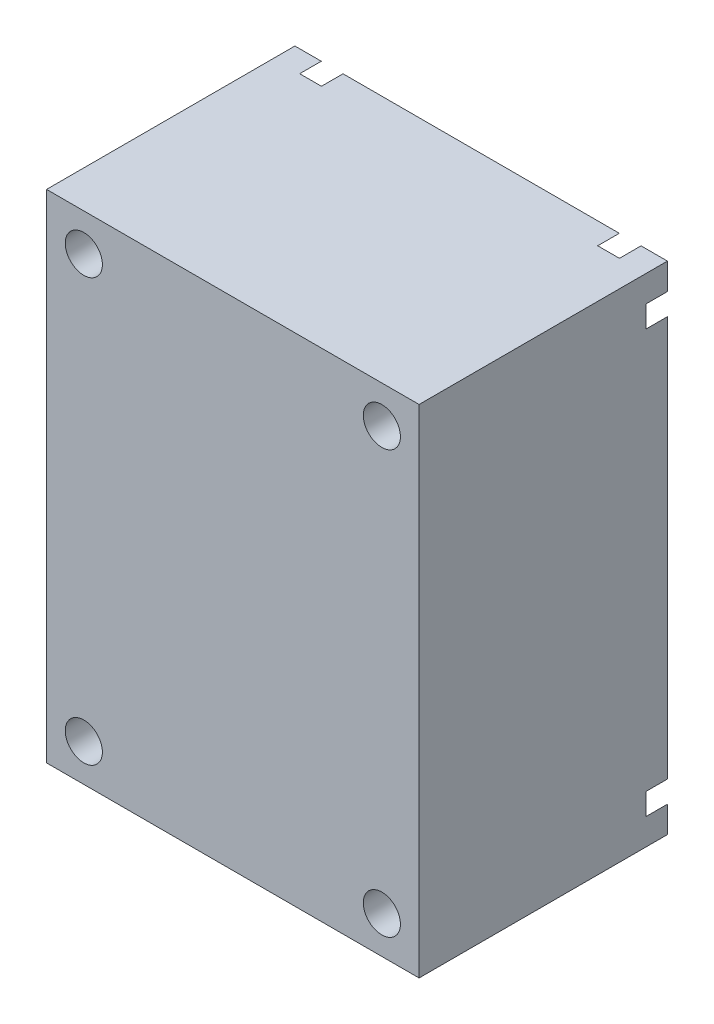
ISO-10303-21;
HEADER;
FILE_DESCRIPTION(('STEP AP214'),'2;1');
FILE_NAME('part.step','',(''),(''),'','','');
FILE_SCHEMA(('AUTOMOTIVE_DESIGN { 1 0 10303 214 1 1 1 1 }'));
ENDSEC;
DATA;
#1=APPLICATION_CONTEXT('core data for automotive mechanical design processes');
#2=APPLICATION_PROTOCOL_DEFINITION('international standard','automotive_design',2000,#1);
#3=PRODUCT_CONTEXT('',#1,'mechanical');
#4=PRODUCT('Part','Part','',(#3));
#5=PRODUCT_RELATED_PRODUCT_CATEGORY('part','',(#4));
#6=PRODUCT_DEFINITION_FORMATION('','',#4);
#7=PRODUCT_DEFINITION_CONTEXT('part definition',#1,'design');
#8=PRODUCT_DEFINITION('design','',#6,#7);
#9=PRODUCT_DEFINITION_SHAPE('','',#8);
#10=(LENGTH_UNIT() NAMED_UNIT(*) SI_UNIT(.MILLI.,.METRE.));
#11=(NAMED_UNIT(*) PLANE_ANGLE_UNIT() SI_UNIT($,.RADIAN.));
#12=(NAMED_UNIT(*) SI_UNIT($,.STERADIAN.) SOLID_ANGLE_UNIT());
#13=UNCERTAINTY_MEASURE_WITH_UNIT(LENGTH_MEASURE(1.E-05),#10,'distance_accuracy_value','');
#14=(GEOMETRIC_REPRESENTATION_CONTEXT(3) GLOBAL_UNCERTAINTY_ASSIGNED_CONTEXT((#13)) GLOBAL_UNIT_ASSIGNED_CONTEXT((#10,
#11,#12)) REPRESENTATION_CONTEXT('',''));
#15=CARTESIAN_POINT('',(0.,0.,0.));
#16=DIRECTION('',(0.,0.,1.));
#17=DIRECTION('',(1.,0.,0.));
#18=AXIS2_PLACEMENT_3D('',#15,#16,#17);
#19=CARTESIAN_POINT('',(0.,0.,-25.4));
#20=DIRECTION('',(0.,0.,-1.));
#21=DIRECTION('',(1.,0.,0.));
#22=AXIS2_PLACEMENT_3D('',#19,#20,#21);
#23=PLANE('',#22);
#24=CARTESIAN_POINT('',(-47.7550602409639,35.4375903614458,-25.4));
#25=DIRECTION('',(0.,0.,1.));
#26=DIRECTION('',(1.,0.,0.));
#27=AXIS2_PLACEMENT_3D('',#24,#25,#26);
#28=CIRCLE('',#27,3.96875);
#29=CARTESIAN_POINT('',(-48.8663102409638,39.2475903614458,-25.4));
#30=VERTEX_POINT('',#29);
#31=CARTESIAN_POINT('',(-51.5650602409639,36.5488403614458,-25.4));
#32=VERTEX_POINT('',#31);
#33=EDGE_CURVE('E179',#30,#32,#28,.T.);
#34=ORIENTED_EDGE('',*,*,#33,.T.);
#35=DIRECTION('',(0.,-1.,0.));
#36=VECTOR('',#35,1.);
#37=CARTESIAN_POINT('',(-51.5650602409639,39.2475903614458,-25.4));
#38=LINE('',#37,#36);
#39=CARTESIAN_POINT('',(-51.5650602409639,39.2475903614458,-25.4));
#40=VERTEX_POINT('',#39);
#41=EDGE_CURVE('E253',#40,#32,#38,.T.);
#42=ORIENTED_EDGE('',*,*,#41,.F.);
#43=DIRECTION('',(-1.,0.,0.));
#44=VECTOR('',#43,1.);
#45=CARTESIAN_POINT('',(-51.5650602409639,39.2475903614458,-25.4));
#46=LINE('',#45,#44);
#47=EDGE_CURVE('E242',#30,#40,#46,.T.);
#48=ORIENTED_EDGE('',*,*,#47,.F.);
#49=EDGE_LOOP('',(#34,#42,#48));
#50=FACE_BOUND('',#49,.T.);
#51=ADVANCED_FACE('F35',(#50),#23,.T.);
#52=CARTESIAN_POINT('',(-17.2750602409638,35.4375903614458,-25.4));
#53=DIRECTION('',(0.,0.,1.));
#54=DIRECTION('',(1.,0.,0.));
#55=AXIS2_PLACEMENT_3D('',#52,#53,#54);
#56=CIRCLE('',#55,3.96875);
#57=CARTESIAN_POINT('',(-13.4650602409638,36.5488403614458,-25.4));
#58=VERTEX_POINT('',#57);
#59=CARTESIAN_POINT('',(-16.1638102409638,39.2475903614458,-25.4));
#60=VERTEX_POINT('',#59);
#61=EDGE_CURVE('E313',#58,#60,#56,.T.);
#62=ORIENTED_EDGE('',*,*,#61,.T.);
#63=CARTESIAN_POINT('',(-13.4650602409638,39.2475903614458,-25.4));
#64=VERTEX_POINT('',#63);
#65=EDGE_CURVE('E226',#64,#60,#46,.T.);
#66=ORIENTED_EDGE('',*,*,#65,.F.);
#67=DIRECTION('',(0.,1.,0.));
#68=VECTOR('',#67,1.);
#69=CARTESIAN_POINT('',(-13.4650602409638,39.2475903614458,-25.4));
#70=LINE('',#69,#68);
#71=EDGE_CURVE('E247',#58,#64,#70,.T.);
#72=ORIENTED_EDGE('',*,*,#71,.F.);
#73=EDGE_LOOP('',(#62,#66,#72));
#74=FACE_BOUND('',#73,.T.);
#75=ADVANCED_FACE('F353',(#74),#23,.T.);
#76=CARTESIAN_POINT('',(-47.7550602409639,-7.74240963855422,-25.4));
#77=DIRECTION('',(0.,0.,1.));
#78=DIRECTION('',(1.,0.,0.));
#79=AXIS2_PLACEMENT_3D('',#76,#77,#78);
#80=CIRCLE('',#79,3.96875);
#81=CARTESIAN_POINT('',(-51.5650602409639,-8.85365963855422,-25.4));
#82=VERTEX_POINT('',#81);
#83=CARTESIAN_POINT('',(-48.8663102409638,-11.5524096385542,-25.4));
#84=VERTEX_POINT('',#83);
#85=EDGE_CURVE('E294',#82,#84,#80,.T.);
#86=ORIENTED_EDGE('',*,*,#85,.T.);
#87=DIRECTION('',(1.,0.,0.));
#88=VECTOR('',#87,1.);
#89=CARTESIAN_POINT('',(-51.5650602409639,-11.5524096385542,-25.4));
#90=LINE('',#89,#88);
#91=CARTESIAN_POINT('',(-51.5650602409639,-11.5524096385542,-25.4));
#92=VERTEX_POINT('',#91);
#93=EDGE_CURVE('E248',#92,#84,#90,.T.);
#94=ORIENTED_EDGE('',*,*,#93,.F.);
#95=EDGE_CURVE('E229',#82,#92,#38,.T.);
#96=ORIENTED_EDGE('',*,*,#95,.F.);
#97=EDGE_LOOP('',(#86,#94,#96));
#98=FACE_BOUND('',#97,.T.);
#99=ADVANCED_FACE('F368',(#98),#23,.T.);
#100=CARTESIAN_POINT('',(-51.5650602409639,34.3263403614458,-25.4));
#101=VERTEX_POINT('',#100);
#102=CARTESIAN_POINT('',(-46.6438102409639,39.2475903614458,-25.4));
#103=VERTEX_POINT('',#102);
#104=EDGE_CURVE('E328',#101,#103,#28,.T.);
#105=ORIENTED_EDGE('',*,*,#104,.T.);
#106=CARTESIAN_POINT('',(-18.3863102409638,39.2475903614458,-25.4));
#107=VERTEX_POINT('',#106);
#108=EDGE_CURVE('E185',#107,#103,#46,.T.);
#109=ORIENTED_EDGE('',*,*,#108,.F.);
#110=CARTESIAN_POINT('',(-13.4650602409638,34.3263403614457,-25.4));
#111=VERTEX_POINT('',#110);
#112=EDGE_CURVE('E316',#107,#111,#56,.T.);
#113=ORIENTED_EDGE('',*,*,#112,.T.);
#114=CARTESIAN_POINT('',(-13.4650602409638,-6.63115963855423,-25.4));
#115=VERTEX_POINT('',#114);
#116=EDGE_CURVE('E246',#115,#111,#70,.T.);
#117=ORIENTED_EDGE('',*,*,#116,.F.);
#118=CARTESIAN_POINT('',(-17.2750602409638,-7.74240963855423,-25.4));
#119=DIRECTION('',(0.,0.,1.));
#120=DIRECTION('',(1.,0.,0.));
#121=AXIS2_PLACEMENT_3D('',#118,#119,#120);
#122=CIRCLE('',#121,3.96875);
#123=CARTESIAN_POINT('',(-18.3863102409638,-11.5524096385542,-25.4));
#124=VERTEX_POINT('',#123);
#125=EDGE_CURVE('E273',#115,#124,#122,.T.);
#126=ORIENTED_EDGE('',*,*,#125,.T.);
#127=CARTESIAN_POINT('',(-46.6438102409639,-11.5524096385542,-25.4));
#128=VERTEX_POINT('',#127);
#129=EDGE_CURVE('E251',#128,#124,#90,.T.);
#130=ORIENTED_EDGE('',*,*,#129,.F.);
#131=CARTESIAN_POINT('',(-51.5650602409639,-6.63115963855423,-25.4));
#132=VERTEX_POINT('',#131);
#133=EDGE_CURVE('E295',#128,#132,#80,.T.);
#134=ORIENTED_EDGE('',*,*,#133,.T.);
#135=EDGE_CURVE('E256',#101,#132,#38,.T.);
#136=ORIENTED_EDGE('',*,*,#135,.F.);
#137=EDGE_LOOP('',(#105,#109,#113,#117,#126,#130,#134,#136));
#138=FACE_BOUND('',#137,.T.);
#139=ADVANCED_FACE('F366',(#138),#23,.T.);
#140=CARTESIAN_POINT('',(-51.5650602409639,39.2475903614458,-25.4));
#141=DIRECTION('',(1.,0.,0.));
#142=DIRECTION('',(0.,0.,1.));
#143=AXIS2_PLACEMENT_3D('',#140,#141,#142);
#144=PLANE('',#143);
#145=DIRECTION('',(0.,1.,0.));
#146=VECTOR('',#145,1.);
#147=CARTESIAN_POINT('',(-51.5650602409639,39.2475903614458,-23.1902));
#148=LINE('',#147,#146);
#149=CARTESIAN_POINT('',(-51.5650602409639,34.3263403614458,-23.1902));
#150=VERTEX_POINT('',#149);
#151=CARTESIAN_POINT('',(-51.5650602409639,36.5488403614458,-23.1902));
#152=VERTEX_POINT('',#151);
#153=EDGE_CURVE('E317',#150,#152,#148,.T.);
#154=ORIENTED_EDGE('',*,*,#153,.F.);
#155=DIRECTION('',(0.,0.,-1.));
#156=VECTOR('',#155,1.);
#157=CARTESIAN_POINT('',(-51.5650602409639,34.3263403614458,-25.4));
#158=LINE('',#157,#156);
#159=EDGE_CURVE('E177',#101,#150,#158,.F.);
#160=ORIENTED_EDGE('',*,*,#159,.F.);
#161=ORIENTED_EDGE('',*,*,#135,.T.);
#162=DIRECTION('',(0.,0.,-1.));
#163=VECTOR('',#162,1.);
#164=CARTESIAN_POINT('',(-51.5650602409639,-6.63115963855423,-25.4));
#165=LINE('',#164,#163);
#166=CARTESIAN_POINT('',(-51.5650602409639,-6.63115963855423,-23.1902));
#167=VERTEX_POINT('',#166);
#168=EDGE_CURVE('E197',#167,#132,#165,.T.);
#169=ORIENTED_EDGE('',*,*,#168,.F.);
#170=DIRECTION('',(0.,1.,0.));
#171=VECTOR('',#170,1.);
#172=CARTESIAN_POINT('',(-51.5650602409639,39.2475903614458,-23.1902));
#173=LINE('',#172,#171);
#174=CARTESIAN_POINT('',(-51.5650602409639,-8.85365963855422,-23.1902));
#175=VERTEX_POINT('',#174);
#176=EDGE_CURVE('E199',#175,#167,#173,.T.);
#177=ORIENTED_EDGE('',*,*,#176,.F.);
#178=DIRECTION('',(0.,0.,-1.));
#179=VECTOR('',#178,1.);
#180=CARTESIAN_POINT('',(-51.5650602409639,-8.85365963855422,-25.4));
#181=LINE('',#180,#179);
#182=EDGE_CURVE('E202',#82,#175,#181,.F.);
#183=ORIENTED_EDGE('',*,*,#182,.F.);
#184=ORIENTED_EDGE('',*,*,#95,.T.);
#185=DIRECTION('',(0.,0.,1.));
#186=VECTOR('',#185,1.);
#187=CARTESIAN_POINT('',(-51.5650602409639,-11.5524096385542,-25.4));
#188=LINE('',#187,#186);
#189=CARTESIAN_POINT('',(-51.5650602409639,-11.5524096385542,0.));
#190=VERTEX_POINT('',#189);
#191=EDGE_CURVE('E214',#92,#190,#188,.T.);
#192=ORIENTED_EDGE('',*,*,#191,.T.);
#193=DIRECTION('',(0.,-1.,0.));
#194=VECTOR('',#193,1.);
#195=CARTESIAN_POINT('',(-51.5650602409639,39.2475903614458,0.));
#196=LINE('',#195,#194);
#197=CARTESIAN_POINT('',(-51.5650602409639,39.2475903614458,0.));
#198=VERTEX_POINT('',#197);
#199=EDGE_CURVE('E236',#198,#190,#196,.T.);
#200=ORIENTED_EDGE('',*,*,#199,.F.);
#201=DIRECTION('',(0.,0.,1.));
#202=VECTOR('',#201,1.);
#203=CARTESIAN_POINT('',(-51.5650602409639,39.2475903614458,-25.4));
#204=LINE('',#203,#202);
#205=EDGE_CURVE('E223',#40,#198,#204,.T.);
#206=ORIENTED_EDGE('',*,*,#205,.F.);
#207=ORIENTED_EDGE('',*,*,#41,.T.);
#208=DIRECTION('',(0.,0.,-1.));
#209=VECTOR('',#208,1.);
#210=CARTESIAN_POINT('',(-51.5650602409639,36.5488403614458,-25.4));
#211=LINE('',#210,#209);
#212=EDGE_CURVE('E319',#152,#32,#211,.T.);
#213=ORIENTED_EDGE('',*,*,#212,.F.);
#214=EDGE_LOOP('',(#154,#160,#161,#169,#177,#183,#184,#192,#200,#206,#207,#213));
#215=FACE_BOUND('',#214,.T.);
#216=ADVANCED_FACE('F37',(#215),#144,.F.);
#217=CARTESIAN_POINT('',(-51.5650602409639,-11.5524096385542,-25.4));
#218=DIRECTION('',(0.,1.,0.));
#219=DIRECTION('',(-1.,0.,0.));
#220=AXIS2_PLACEMENT_3D('',#217,#218,#219);
#221=PLANE('',#220);
#222=DIRECTION('',(-1.,0.,0.));
#223=VECTOR('',#222,1.);
#224=CARTESIAN_POINT('',(-51.5650602409639,-11.5524096385542,-23.1902));
#225=LINE('',#224,#223);
#226=CARTESIAN_POINT('',(-46.6438102409639,-11.5524096385542,-23.1902));
#227=VERTEX_POINT('',#226);
#228=CARTESIAN_POINT('',(-48.8663102409638,-11.5524096385542,-23.1902));
#229=VERTEX_POINT('',#228);
#230=EDGE_CURVE('E277',#227,#229,#225,.T.);
#231=ORIENTED_EDGE('',*,*,#230,.F.);
#232=DIRECTION('',(0.,0.,-1.));
#233=VECTOR('',#232,1.);
#234=CARTESIAN_POINT('',(-46.6438102409639,-11.5524096385542,-25.4));
#235=LINE('',#234,#233);
#236=EDGE_CURVE('E282',#128,#227,#235,.F.);
#237=ORIENTED_EDGE('',*,*,#236,.F.);
#238=ORIENTED_EDGE('',*,*,#129,.T.);
#239=DIRECTION('',(0.,0.,-1.));
#240=VECTOR('',#239,1.);
#241=CARTESIAN_POINT('',(-18.3863102409638,-11.5524096385542,-25.4));
#242=LINE('',#241,#240);
#243=CARTESIAN_POINT('',(-18.3863102409638,-11.5524096385542,-23.1902));
#244=VERTEX_POINT('',#243);
#245=EDGE_CURVE('E259',#244,#124,#242,.T.);
#246=ORIENTED_EDGE('',*,*,#245,.F.);
#247=DIRECTION('',(-1.,0.,0.));
#248=VECTOR('',#247,1.);
#249=CARTESIAN_POINT('',(-51.5650602409639,-11.5524096385542,-23.1902));
#250=LINE('',#249,#248);
#251=CARTESIAN_POINT('',(-16.1638102409639,-11.5524096385542,-23.1902));
#252=VERTEX_POINT('',#251);
#253=EDGE_CURVE('E239',#252,#244,#250,.T.);
#254=ORIENTED_EDGE('',*,*,#253,.F.);
#255=DIRECTION('',(0.,0.,-1.));
#256=VECTOR('',#255,1.);
#257=CARTESIAN_POINT('',(-16.1638102409639,-11.5524096385542,-25.4));
#258=LINE('',#257,#256);
#259=CARTESIAN_POINT('',(-16.1638102409639,-11.5524096385542,-25.4));
#260=VERTEX_POINT('',#259);
#261=EDGE_CURVE('E261',#260,#252,#258,.F.);
#262=ORIENTED_EDGE('',*,*,#261,.F.);
#263=CARTESIAN_POINT('',(-13.4650602409638,-11.5524096385542,-25.4));
#264=VERTEX_POINT('',#263);
#265=EDGE_CURVE('E252',#260,#264,#90,.T.);
#266=ORIENTED_EDGE('',*,*,#265,.T.);
#267=DIRECTION('',(0.,0.,1.));
#268=VECTOR('',#267,1.);
#269=CARTESIAN_POINT('',(-13.4650602409638,-11.5524096385542,-25.4));
#270=LINE('',#269,#268);
#271=CARTESIAN_POINT('',(-13.4650602409638,-11.5524096385542,0.));
#272=VERTEX_POINT('',#271);
#273=EDGE_CURVE('E217',#264,#272,#270,.T.);
#274=ORIENTED_EDGE('',*,*,#273,.T.);
#275=DIRECTION('',(1.,0.,0.));
#276=VECTOR('',#275,1.);
#277=CARTESIAN_POINT('',(-51.5650602409639,-11.5524096385542,0.));
#278=LINE('',#277,#276);
#279=EDGE_CURVE('E233',#190,#272,#278,.T.);
#280=ORIENTED_EDGE('',*,*,#279,.F.);
#281=ORIENTED_EDGE('',*,*,#191,.F.);
#282=ORIENTED_EDGE('',*,*,#93,.T.);
#283=DIRECTION('',(0.,0.,-1.));
#284=VECTOR('',#283,1.);
#285=CARTESIAN_POINT('',(-48.8663102409638,-11.5524096385542,-25.4));
#286=LINE('',#285,#284);
#287=EDGE_CURVE('E280',#229,#84,#286,.T.);
#288=ORIENTED_EDGE('',*,*,#287,.F.);
#289=EDGE_LOOP('',(#231,#237,#238,#246,#254,#262,#266,#274,#280,#281,#282,#288));
#290=FACE_BOUND('',#289,.T.);
#291=ADVANCED_FACE('F375',(#290),#221,.F.);
#292=CARTESIAN_POINT('',(-13.4650602409638,39.2475903614458,-25.4));
#293=DIRECTION('',(-1.,0.,0.));
#294=DIRECTION('',(0.,-1.,0.));
#295=AXIS2_PLACEMENT_3D('',#292,#293,#294);
#296=PLANE('',#295);
#297=DIRECTION('',(0.,-1.,0.));
#298=VECTOR('',#297,1.);
#299=CARTESIAN_POINT('',(-13.4650602409638,39.2475903614458,-23.1902));
#300=LINE('',#299,#298);
#301=CARTESIAN_POINT('',(-13.4650602409638,36.5488403614458,-23.1902));
#302=VERTEX_POINT('',#301);
#303=CARTESIAN_POINT('',(-13.4650602409638,34.3263403614457,-23.1902));
#304=VERTEX_POINT('',#303);
#305=EDGE_CURVE('E193',#302,#304,#300,.T.);
#306=ORIENTED_EDGE('',*,*,#305,.F.);
#307=DIRECTION('',(0.,0.,-1.));
#308=VECTOR('',#307,1.);
#309=CARTESIAN_POINT('',(-13.4650602409638,36.5488403614458,-25.4));
#310=LINE('',#309,#308);
#311=EDGE_CURVE('E195',#58,#302,#310,.F.);
#312=ORIENTED_EDGE('',*,*,#311,.F.);
#313=ORIENTED_EDGE('',*,*,#71,.T.);
#314=DIRECTION('',(0.,0.,1.));
#315=VECTOR('',#314,1.);
#316=CARTESIAN_POINT('',(-13.4650602409638,39.2475903614458,-25.4));
#317=LINE('',#316,#315);
#318=CARTESIAN_POINT('',(-13.4650602409638,39.2475903614458,0.));
#319=VERTEX_POINT('',#318);
#320=EDGE_CURVE('E220',#64,#319,#317,.T.);
#321=ORIENTED_EDGE('',*,*,#320,.T.);
#322=DIRECTION('',(0.,1.,0.));
#323=VECTOR('',#322,1.);
#324=CARTESIAN_POINT('',(-13.4650602409638,39.2475903614458,0.));
#325=LINE('',#324,#323);
#326=EDGE_CURVE('E230',#272,#319,#325,.T.);
#327=ORIENTED_EDGE('',*,*,#326,.F.);
#328=ORIENTED_EDGE('',*,*,#273,.F.);
#329=CARTESIAN_POINT('',(-13.4650602409638,-8.85365963855422,-25.4));
#330=VERTEX_POINT('',#329);
#331=EDGE_CURVE('E243',#264,#330,#70,.T.);
#332=ORIENTED_EDGE('',*,*,#331,.T.);
#333=DIRECTION('',(0.,0.,-1.));
#334=VECTOR('',#333,1.);
#335=CARTESIAN_POINT('',(-13.4650602409638,-8.85365963855422,-25.4));
#336=LINE('',#335,#334);
#337=CARTESIAN_POINT('',(-13.4650602409638,-8.85365963855422,-23.1902));
#338=VERTEX_POINT('',#337);
#339=EDGE_CURVE('E205',#338,#330,#336,.T.);
#340=ORIENTED_EDGE('',*,*,#339,.F.);
#341=DIRECTION('',(0.,-1.,0.));
#342=VECTOR('',#341,1.);
#343=CARTESIAN_POINT('',(-13.4650602409638,39.2475903614458,-23.1902));
#344=LINE('',#343,#342);
#345=CARTESIAN_POINT('',(-13.4650602409638,-6.63115963855423,-23.1902));
#346=VERTEX_POINT('',#345);
#347=EDGE_CURVE('E208',#346,#338,#344,.T.);
#348=ORIENTED_EDGE('',*,*,#347,.F.);
#349=DIRECTION('',(0.,0.,-1.));
#350=VECTOR('',#349,1.);
#351=CARTESIAN_POINT('',(-13.4650602409638,-6.63115963855423,-25.4));
#352=LINE('',#351,#350);
#353=EDGE_CURVE('E211',#115,#346,#352,.F.);
#354=ORIENTED_EDGE('',*,*,#353,.F.);
#355=ORIENTED_EDGE('',*,*,#116,.T.);
#356=DIRECTION('',(0.,0.,-1.));
#357=VECTOR('',#356,1.);
#358=CARTESIAN_POINT('',(-13.4650602409638,34.3263403614457,-25.4));
#359=LINE('',#358,#357);
#360=EDGE_CURVE('E189',#304,#111,#359,.T.);
#361=ORIENTED_EDGE('',*,*,#360,.F.);
#362=EDGE_LOOP('',(#306,#312,#313,#321,#327,#328,#332,#340,#348,#354,#355,#361));
#363=FACE_BOUND('',#362,.T.);
#364=ADVANCED_FACE('F348',(#363),#296,.F.);
#365=CARTESIAN_POINT('',(-51.5650602409639,39.2475903614458,-25.4));
#366=DIRECTION('',(0.,-1.,0.));
#367=DIRECTION('',(0.,0.,1.));
#368=AXIS2_PLACEMENT_3D('',#365,#366,#367);
#369=PLANE('',#368);
#370=DIRECTION('',(1.,0.,0.));
#371=VECTOR('',#370,1.);
#372=CARTESIAN_POINT('',(-51.5650602409639,39.2475903614458,-23.1902));
#373=LINE('',#372,#371);
#374=CARTESIAN_POINT('',(-48.8663102409638,39.2475903614458,-23.1902));
#375=VERTEX_POINT('',#374);
#376=CARTESIAN_POINT('',(-46.6438102409639,39.2475903614458,-23.1902));
#377=VERTEX_POINT('',#376);
#378=EDGE_CURVE('E43',#375,#377,#373,.T.);
#379=ORIENTED_EDGE('',*,*,#378,.F.);
#380=DIRECTION('',(0.,0.,-1.));
#381=VECTOR('',#380,1.);
#382=CARTESIAN_POINT('',(-48.8663102409638,39.2475903614458,-25.4));
#383=LINE('',#382,#381);
#384=EDGE_CURVE('E188',#30,#375,#383,.F.);
#385=ORIENTED_EDGE('',*,*,#384,.F.);
#386=ORIENTED_EDGE('',*,*,#47,.T.);
#387=ORIENTED_EDGE('',*,*,#205,.T.);
#388=DIRECTION('',(-1.,0.,0.));
#389=VECTOR('',#388,1.);
#390=CARTESIAN_POINT('',(-51.5650602409639,39.2475903614458,0.));
#391=LINE('',#390,#389);
#392=EDGE_CURVE('E227',#319,#198,#391,.T.);
#393=ORIENTED_EDGE('',*,*,#392,.F.);
#394=ORIENTED_EDGE('',*,*,#320,.F.);
#395=ORIENTED_EDGE('',*,*,#65,.T.);
#396=DIRECTION('',(0.,0.,-1.));
#397=VECTOR('',#396,1.);
#398=CARTESIAN_POINT('',(-16.1638102409638,39.2475903614458,-25.4));
#399=LINE('',#398,#397);
#400=CARTESIAN_POINT('',(-16.1638102409638,39.2475903614458,-23.1902));
#401=VERTEX_POINT('',#400);
#402=EDGE_CURVE('E300',#401,#60,#399,.T.);
#403=ORIENTED_EDGE('',*,*,#402,.F.);
#404=DIRECTION('',(1.,0.,0.));
#405=VECTOR('',#404,1.);
#406=CARTESIAN_POINT('',(-51.5650602409639,39.2475903614458,-23.1902));
#407=LINE('',#406,#405);
#408=CARTESIAN_POINT('',(-18.3863102409638,39.2475903614458,-23.1902));
#409=VERTEX_POINT('',#408);
#410=EDGE_CURVE('E298',#409,#401,#407,.T.);
#411=ORIENTED_EDGE('',*,*,#410,.F.);
#412=DIRECTION('',(0.,0.,-1.));
#413=VECTOR('',#412,1.);
#414=CARTESIAN_POINT('',(-18.3863102409638,39.2475903614458,-25.4));
#415=LINE('',#414,#413);
#416=EDGE_CURVE('E302',#107,#409,#415,.F.);
#417=ORIENTED_EDGE('',*,*,#416,.F.);
#418=ORIENTED_EDGE('',*,*,#108,.T.);
#419=DIRECTION('',(0.,0.,-1.));
#420=VECTOR('',#419,1.);
#421=CARTESIAN_POINT('',(-46.6438102409639,39.2475903614458,-25.4));
#422=LINE('',#421,#420);
#423=EDGE_CURVE('E11',#377,#103,#422,.T.);
#424=ORIENTED_EDGE('',*,*,#423,.F.);
#425=EDGE_LOOP('',(#379,#385,#386,#387,#393,#394,#395,#403,#411,#417,#418,#424));
#426=FACE_BOUND('',#425,.T.);
#427=ADVANCED_FACE('F183',(#426),#369,.F.);
#428=EDGE_CURVE('E276',#260,#330,#122,.T.);
#429=ORIENTED_EDGE('',*,*,#428,.T.);
#430=ORIENTED_EDGE('',*,*,#331,.F.);
#431=ORIENTED_EDGE('',*,*,#265,.F.);
#432=EDGE_LOOP('',(#429,#430,#431));
#433=FACE_BOUND('',#432,.T.);
#434=ADVANCED_FACE('F370',(#433),#23,.T.);
#435=CARTESIAN_POINT('',(0.,0.,0.));
#436=DIRECTION('',(0.,0.,-1.));
#437=DIRECTION('',(1.,0.,0.));
#438=AXIS2_PLACEMENT_3D('',#435,#436,#437);
#439=PLANE('',#438);
#440=CARTESIAN_POINT('',(-47.7550602409639,35.4375903614458,0.));
#441=DIRECTION('',(0.,0.,1.));
#442=DIRECTION('',(1.,0.,0.));
#443=AXIS2_PLACEMENT_3D('',#440,#441,#442);
#444=CIRCLE('',#443,1.89864999999999);
#445=CARTESIAN_POINT('',(-45.8564102409639,35.4375903614458,0.));
#446=VERTEX_POINT('',#445);
#447=EDGE_CURVE('E322',#446,#446,#444,.T.);
#448=ORIENTED_EDGE('',*,*,#447,.F.);
#449=EDGE_LOOP('',(#448));
#450=FACE_BOUND('',#449,.T.);
#451=CARTESIAN_POINT('',(-17.2750602409638,35.4375903614458,0.));
#452=DIRECTION('',(0.,0.,1.));
#453=DIRECTION('',(1.,0.,0.));
#454=AXIS2_PLACEMENT_3D('',#451,#452,#453);
#455=CIRCLE('',#454,1.89864999999999);
#456=CARTESIAN_POINT('',(-15.3764102409638,35.4375903614458,0.));
#457=VERTEX_POINT('',#456);
#458=EDGE_CURVE('E305',#457,#457,#455,.T.);
#459=ORIENTED_EDGE('',*,*,#458,.F.);
#460=EDGE_LOOP('',(#459));
#461=FACE_BOUND('',#460,.T.);
#462=CARTESIAN_POINT('',(-47.7550602409639,-7.74240963855422,0.));
#463=DIRECTION('',(0.,0.,1.));
#464=DIRECTION('',(1.,0.,0.));
#465=AXIS2_PLACEMENT_3D('',#462,#463,#464);
#466=CIRCLE('',#465,1.89864999999999);
#467=CARTESIAN_POINT('',(-45.8564102409639,-7.74240963855422,0.));
#468=VERTEX_POINT('',#467);
#469=EDGE_CURVE('E285',#468,#468,#466,.T.);
#470=ORIENTED_EDGE('',*,*,#469,.F.);
#471=EDGE_LOOP('',(#470));
#472=FACE_BOUND('',#471,.T.);
#473=CARTESIAN_POINT('',(-17.2750602409638,-7.74240963855423,0.));
#474=DIRECTION('',(0.,0.,1.));
#475=DIRECTION('',(1.,0.,0.));
#476=AXIS2_PLACEMENT_3D('',#473,#474,#475);
#477=CIRCLE('',#476,1.89864999999999);
#478=CARTESIAN_POINT('',(-15.3764102409638,-7.74240963855423,0.));
#479=VERTEX_POINT('',#478);
#480=EDGE_CURVE('E264',#479,#479,#477,.T.);
#481=ORIENTED_EDGE('',*,*,#480,.F.);
#482=EDGE_LOOP('',(#481));
#483=FACE_BOUND('',#482,.T.);
#484=ORIENTED_EDGE('',*,*,#199,.T.);
#485=ORIENTED_EDGE('',*,*,#279,.T.);
#486=ORIENTED_EDGE('',*,*,#326,.T.);
#487=ORIENTED_EDGE('',*,*,#392,.T.);
#488=EDGE_LOOP('',(#484,#485,#486,#487));
#489=FACE_BOUND('',#488,.T.);
#490=ADVANCED_FACE('F344',(#450,#461,#472,#483,#489),#439,.F.);
#491=CARTESIAN_POINT('',(-15.3764102409638,-7.74240963855423,-23.1902));
#492=DIRECTION('',(0.,0.,1.));
#493=DIRECTION('',(-1.,0.,0.));
#494=AXIS2_PLACEMENT_3D('',#491,#492,#493);
#495=PLANE('',#494);
#496=CARTESIAN_POINT('',(-17.2750602409638,-7.74240963855423,-23.1902));
#497=DIRECTION('',(0.,0.,1.));
#498=DIRECTION('',(1.,0.,0.));
#499=AXIS2_PLACEMENT_3D('',#496,#497,#498);
#500=CIRCLE('',#499,1.89865);
#501=CARTESIAN_POINT('',(-15.3764102409638,-7.74240963855423,-23.1902));
#502=VERTEX_POINT('',#501);
#503=EDGE_CURVE('E267',#502,#502,#500,.T.);
#504=ORIENTED_EDGE('',*,*,#503,.T.);
#505=EDGE_LOOP('',(#504));
#506=FACE_BOUND('',#505,.T.);
#507=CARTESIAN_POINT('',(-17.2750602409638,-7.74240963855423,-23.1902));
#508=DIRECTION('',(0.,0.,1.));
#509=DIRECTION('',(1.,0.,0.));
#510=AXIS2_PLACEMENT_3D('',#507,#508,#509);
#511=CIRCLE('',#510,3.96875);
#512=EDGE_CURVE('E272',#252,#338,#511,.T.);
#513=ORIENTED_EDGE('',*,*,#512,.F.);
#514=ORIENTED_EDGE('',*,*,#253,.T.);
#515=EDGE_CURVE('E270',#346,#244,#511,.T.);
#516=ORIENTED_EDGE('',*,*,#515,.F.);
#517=ORIENTED_EDGE('',*,*,#347,.T.);
#518=EDGE_LOOP('',(#513,#514,#516,#517));
#519=FACE_BOUND('',#518,.T.);
#520=ADVANCED_FACE('F440',(#506,#519),#495,.F.);
#521=CARTESIAN_POINT('',(-17.2750602409638,-7.74240963855423,-25.4));
#522=DIRECTION('',(0.,0.,-1.));
#523=DIRECTION('',(1.,0.,0.));
#524=AXIS2_PLACEMENT_3D('',#521,#522,#523);
#525=CYLINDRICAL_SURFACE('',#524,3.96875);
#526=ORIENTED_EDGE('',*,*,#515,.T.);
#527=ORIENTED_EDGE('',*,*,#245,.T.);
#528=ORIENTED_EDGE('',*,*,#125,.F.);
#529=ORIENTED_EDGE('',*,*,#353,.T.);
#530=EDGE_LOOP('',(#526,#527,#528,#529));
#531=FACE_BOUND('',#530,.T.);
#532=ADVANCED_FACE('F449',(#531),#525,.F.);
#533=ORIENTED_EDGE('',*,*,#428,.F.);
#534=ORIENTED_EDGE('',*,*,#261,.T.);
#535=ORIENTED_EDGE('',*,*,#512,.T.);
#536=ORIENTED_EDGE('',*,*,#339,.T.);
#537=EDGE_LOOP('',(#533,#534,#535,#536));
#538=FACE_BOUND('',#537,.T.);
#539=ADVANCED_FACE('F459',(#538),#525,.F.);
#540=CARTESIAN_POINT('',(-17.2750602409638,-7.74240963855423,-25.4));
#541=DIRECTION('',(0.,0.,-1.));
#542=DIRECTION('',(1.,0.,0.));
#543=AXIS2_PLACEMENT_3D('',#540,#541,#542);
#544=CYLINDRICAL_SURFACE('',#543,1.89865);
#545=ORIENTED_EDGE('',*,*,#480,.T.);
#546=EDGE_LOOP('',(#545));
#547=FACE_BOUND('',#546,.T.);
#548=ORIENTED_EDGE('',*,*,#503,.F.);
#549=EDGE_LOOP('',(#548));
#550=FACE_BOUND('',#549,.T.);
#551=ADVANCED_FACE('F469',(#547,#550),#544,.F.);
#552=CARTESIAN_POINT('',(-45.8564102409638,-7.74240963855422,-23.1902));
#553=DIRECTION('',(0.,0.,1.));
#554=DIRECTION('',(-1.,0.,0.));
#555=AXIS2_PLACEMENT_3D('',#552,#553,#554);
#556=PLANE('',#555);
#557=CARTESIAN_POINT('',(-47.7550602409639,-7.74240963855422,-23.1902));
#558=DIRECTION('',(0.,0.,1.));
#559=DIRECTION('',(1.,0.,0.));
#560=AXIS2_PLACEMENT_3D('',#557,#558,#559);
#561=CIRCLE('',#560,1.89865);
#562=CARTESIAN_POINT('',(-45.8564102409638,-7.74240963855422,-23.1902));
#563=VERTEX_POINT('',#562);
#564=EDGE_CURVE('E288',#563,#563,#561,.T.);
#565=ORIENTED_EDGE('',*,*,#564,.T.);
#566=EDGE_LOOP('',(#565));
#567=FACE_BOUND('',#566,.T.);
#568=CARTESIAN_POINT('',(-47.7550602409639,-7.74240963855422,-23.1902));
#569=DIRECTION('',(0.,0.,1.));
#570=DIRECTION('',(1.,0.,0.));
#571=AXIS2_PLACEMENT_3D('',#568,#569,#570);
#572=CIRCLE('',#571,3.96875);
#573=EDGE_CURVE('E292',#227,#167,#572,.T.);
#574=ORIENTED_EDGE('',*,*,#573,.F.);
#575=ORIENTED_EDGE('',*,*,#230,.T.);
#576=EDGE_CURVE('E291',#175,#229,#572,.T.);
#577=ORIENTED_EDGE('',*,*,#576,.F.);
#578=ORIENTED_EDGE('',*,*,#176,.T.);
#579=EDGE_LOOP('',(#574,#575,#577,#578));
#580=FACE_BOUND('',#579,.T.);
#581=ADVANCED_FACE('F478',(#567,#580),#556,.F.);
#582=CARTESIAN_POINT('',(-47.7550602409639,-7.74240963855422,-25.4));
#583=DIRECTION('',(0.,0.,-1.));
#584=DIRECTION('',(1.,0.,0.));
#585=AXIS2_PLACEMENT_3D('',#582,#583,#584);
#586=CYLINDRICAL_SURFACE('',#585,3.96875);
#587=ORIENTED_EDGE('',*,*,#576,.T.);
#588=ORIENTED_EDGE('',*,*,#287,.T.);
#589=ORIENTED_EDGE('',*,*,#85,.F.);
#590=ORIENTED_EDGE('',*,*,#182,.T.);
#591=EDGE_LOOP('',(#587,#588,#589,#590));
#592=FACE_BOUND('',#591,.T.);
#593=ADVANCED_FACE('F487',(#592),#586,.F.);
#594=ORIENTED_EDGE('',*,*,#133,.F.);
#595=ORIENTED_EDGE('',*,*,#236,.T.);
#596=ORIENTED_EDGE('',*,*,#573,.T.);
#597=ORIENTED_EDGE('',*,*,#168,.T.);
#598=EDGE_LOOP('',(#594,#595,#596,#597));
#599=FACE_BOUND('',#598,.T.);
#600=ADVANCED_FACE('F497',(#599),#586,.F.);
#601=CARTESIAN_POINT('',(-47.7550602409639,-7.74240963855422,-25.4));
#602=DIRECTION('',(0.,0.,-1.));
#603=DIRECTION('',(1.,0.,0.));
#604=AXIS2_PLACEMENT_3D('',#601,#602,#603);
#605=CYLINDRICAL_SURFACE('',#604,1.89865);
#606=ORIENTED_EDGE('',*,*,#469,.T.);
#607=EDGE_LOOP('',(#606));
#608=FACE_BOUND('',#607,.T.);
#609=ORIENTED_EDGE('',*,*,#564,.F.);
#610=EDGE_LOOP('',(#609));
#611=FACE_BOUND('',#610,.T.);
#612=ADVANCED_FACE('F507',(#608,#611),#605,.F.);
#613=CARTESIAN_POINT('',(-15.3764102409638,35.4375903614458,-23.1902));
#614=DIRECTION('',(0.,0.,1.));
#615=DIRECTION('',(-1.,0.,0.));
#616=AXIS2_PLACEMENT_3D('',#613,#614,#615);
#617=PLANE('',#616);
#618=CARTESIAN_POINT('',(-17.2750602409638,35.4375903614458,-23.1902));
#619=DIRECTION('',(0.,0.,1.));
#620=DIRECTION('',(1.,0.,0.));
#621=AXIS2_PLACEMENT_3D('',#618,#619,#620);
#622=CIRCLE('',#621,1.89865);
#623=CARTESIAN_POINT('',(-15.3764102409638,35.4375903614458,-23.1902));
#624=VERTEX_POINT('',#623);
#625=EDGE_CURVE('E308',#624,#624,#622,.T.);
#626=ORIENTED_EDGE('',*,*,#625,.T.);
#627=EDGE_LOOP('',(#626));
#628=FACE_BOUND('',#627,.T.);
#629=CARTESIAN_POINT('',(-17.2750602409638,35.4375903614458,-23.1902));
#630=DIRECTION('',(0.,0.,1.));
#631=DIRECTION('',(1.,0.,0.));
#632=AXIS2_PLACEMENT_3D('',#629,#630,#631);
#633=CIRCLE('',#632,3.96875);
#634=EDGE_CURVE('E312',#409,#304,#633,.T.);
#635=ORIENTED_EDGE('',*,*,#634,.F.);
#636=ORIENTED_EDGE('',*,*,#410,.T.);
#637=EDGE_CURVE('E58',#302,#401,#633,.T.);
#638=ORIENTED_EDGE('',*,*,#637,.F.);
#639=ORIENTED_EDGE('',*,*,#305,.T.);
#640=EDGE_LOOP('',(#635,#636,#638,#639));
#641=FACE_BOUND('',#640,.T.);
#642=ADVANCED_FACE('F358',(#628,#641),#617,.F.);
#643=CARTESIAN_POINT('',(-17.2750602409638,35.4375903614458,-25.4));
#644=DIRECTION('',(0.,0.,-1.));
#645=DIRECTION('',(1.,0.,0.));
#646=AXIS2_PLACEMENT_3D('',#643,#644,#645);
#647=CYLINDRICAL_SURFACE('',#646,3.96875);
#648=ORIENTED_EDGE('',*,*,#637,.T.);
#649=ORIENTED_EDGE('',*,*,#402,.T.);
#650=ORIENTED_EDGE('',*,*,#61,.F.);
#651=ORIENTED_EDGE('',*,*,#311,.T.);
#652=EDGE_LOOP('',(#648,#649,#650,#651));
#653=FACE_BOUND('',#652,.T.);
#654=ADVANCED_FACE('F357',(#653),#647,.F.);
#655=ORIENTED_EDGE('',*,*,#112,.F.);
#656=ORIENTED_EDGE('',*,*,#416,.T.);
#657=ORIENTED_EDGE('',*,*,#634,.T.);
#658=ORIENTED_EDGE('',*,*,#360,.T.);
#659=EDGE_LOOP('',(#655,#656,#657,#658));
#660=FACE_BOUND('',#659,.T.);
#661=ADVANCED_FACE('F362',(#660),#647,.F.);
#662=CARTESIAN_POINT('',(-17.2750602409638,35.4375903614458,-25.4));
#663=DIRECTION('',(0.,0.,-1.));
#664=DIRECTION('',(1.,0.,0.));
#665=AXIS2_PLACEMENT_3D('',#662,#663,#664);
#666=CYLINDRICAL_SURFACE('',#665,1.89865);
#667=ORIENTED_EDGE('',*,*,#458,.T.);
#668=EDGE_LOOP('',(#667));
#669=FACE_BOUND('',#668,.T.);
#670=ORIENTED_EDGE('',*,*,#625,.F.);
#671=EDGE_LOOP('',(#670));
#672=FACE_BOUND('',#671,.T.);
#673=ADVANCED_FACE('F542',(#669,#672),#666,.F.);
#674=CARTESIAN_POINT('',(-45.8564102409638,35.4375903614458,-23.1902));
#675=DIRECTION('',(0.,0.,1.));
#676=DIRECTION('',(-1.,0.,0.));
#677=AXIS2_PLACEMENT_3D('',#674,#675,#676);
#678=PLANE('',#677);
#679=CARTESIAN_POINT('',(-47.7550602409639,35.4375903614458,-23.1902));
#680=DIRECTION('',(0.,0.,1.));
#681=DIRECTION('',(1.,0.,0.));
#682=AXIS2_PLACEMENT_3D('',#679,#680,#681);
#683=CIRCLE('',#682,1.89865);
#684=CARTESIAN_POINT('',(-45.8564102409638,35.4375903614458,-23.1902));
#685=VERTEX_POINT('',#684);
#686=EDGE_CURVE('E325',#685,#685,#683,.T.);
#687=ORIENTED_EDGE('',*,*,#686,.T.);
#688=EDGE_LOOP('',(#687));
#689=FACE_BOUND('',#688,.T.);
#690=CARTESIAN_POINT('',(-47.7550602409639,35.4375903614458,-23.1902));
#691=DIRECTION('',(0.,0.,1.));
#692=DIRECTION('',(1.,0.,0.));
#693=AXIS2_PLACEMENT_3D('',#690,#691,#692);
#694=CIRCLE('',#693,3.96875);
#695=EDGE_CURVE('E172',#150,#377,#694,.T.);
#696=ORIENTED_EDGE('',*,*,#695,.F.);
#697=ORIENTED_EDGE('',*,*,#153,.T.);
#698=EDGE_CURVE('E50',#375,#152,#694,.T.);
#699=ORIENTED_EDGE('',*,*,#698,.F.);
#700=ORIENTED_EDGE('',*,*,#378,.T.);
#701=EDGE_LOOP('',(#696,#697,#699,#700));
#702=FACE_BOUND('',#701,.T.);
#703=ADVANCED_FACE('F187',(#689,#702),#678,.F.);
#704=CARTESIAN_POINT('',(-47.7550602409639,35.4375903614458,-25.4));
#705=DIRECTION('',(0.,0.,-1.));
#706=DIRECTION('',(1.,0.,0.));
#707=AXIS2_PLACEMENT_3D('',#704,#705,#706);
#708=CYLINDRICAL_SURFACE('',#707,3.96875);
#709=ORIENTED_EDGE('',*,*,#698,.T.);
#710=ORIENTED_EDGE('',*,*,#212,.T.);
#711=ORIENTED_EDGE('',*,*,#33,.F.);
#712=ORIENTED_EDGE('',*,*,#384,.T.);
#713=EDGE_LOOP('',(#709,#710,#711,#712));
#714=FACE_BOUND('',#713,.T.);
#715=ADVANCED_FACE('F338',(#714),#708,.F.);
#716=ORIENTED_EDGE('',*,*,#104,.F.);
#717=ORIENTED_EDGE('',*,*,#159,.T.);
#718=ORIENTED_EDGE('',*,*,#695,.T.);
#719=ORIENTED_EDGE('',*,*,#423,.T.);
#720=EDGE_LOOP('',(#716,#717,#718,#719));
#721=FACE_BOUND('',#720,.T.);
#722=ADVANCED_FACE('F175',(#721),#708,.F.);
#723=CARTESIAN_POINT('',(-47.7550602409639,35.4375903614458,-25.4));
#724=DIRECTION('',(0.,0.,-1.));
#725=DIRECTION('',(1.,0.,0.));
#726=AXIS2_PLACEMENT_3D('',#723,#724,#725);
#727=CYLINDRICAL_SURFACE('',#726,1.89865);
#728=ORIENTED_EDGE('',*,*,#447,.T.);
#729=EDGE_LOOP('',(#728));
#730=FACE_BOUND('',#729,.T.);
#731=ORIENTED_EDGE('',*,*,#686,.F.);
#732=EDGE_LOOP('',(#731));
#733=FACE_BOUND('',#732,.T.);
#734=ADVANCED_FACE('F576',(#730,#733),#727,.F.);
#735=CLOSED_SHELL('',(#51,#75,#99,#139,#216,#291,#364,#427,#434,#490,#520,#532,#539,#551,#581,
#593,#600,#612,#642,#654,#661,#673,#703,#715,#722,#734));
#736=MANIFOLD_SOLID_BREP('B2',#735);
#737=ADVANCED_BREP_SHAPE_REPRESENTATION('',(#18,#736),#14);
#738=SHAPE_DEFINITION_REPRESENTATION(#9,#737);
ENDSEC;
END-ISO-10303-21;
